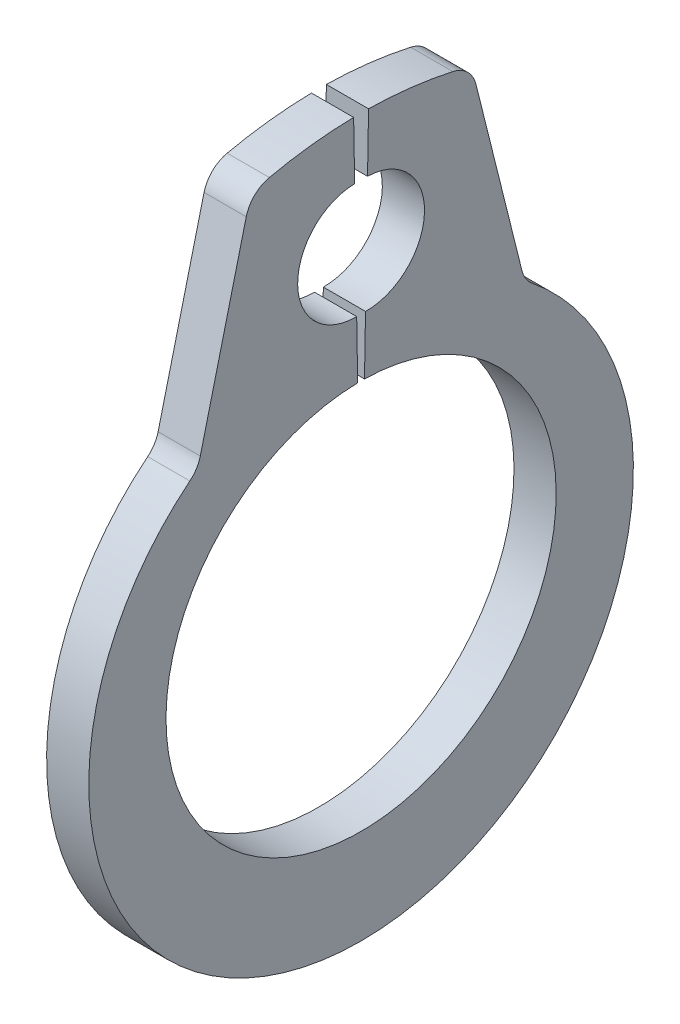
ISO-10303-21;
HEADER;
FILE_DESCRIPTION(('STEP AP214'),'2;1');
FILE_NAME('part.step','',(''),(''),'','','');
FILE_SCHEMA(('AUTOMOTIVE_DESIGN { 1 0 10303 214 1 1 1 1 }'));
ENDSEC;
DATA;
#1=APPLICATION_CONTEXT('core data for automotive mechanical design processes');
#2=APPLICATION_PROTOCOL_DEFINITION('international standard','automotive_design',2000,#1);
#3=PRODUCT_CONTEXT('',#1,'mechanical');
#4=PRODUCT('Part','Part','',(#3));
#5=PRODUCT_RELATED_PRODUCT_CATEGORY('part','',(#4));
#6=PRODUCT_DEFINITION_FORMATION('','',#4);
#7=PRODUCT_DEFINITION_CONTEXT('part definition',#1,'design');
#8=PRODUCT_DEFINITION('design','',#6,#7);
#9=PRODUCT_DEFINITION_SHAPE('','',#8);
#10=(LENGTH_UNIT() NAMED_UNIT(*) SI_UNIT(.MILLI.,.METRE.));
#11=(NAMED_UNIT(*) PLANE_ANGLE_UNIT() SI_UNIT($,.RADIAN.));
#12=(NAMED_UNIT(*) SI_UNIT($,.STERADIAN.) SOLID_ANGLE_UNIT());
#13=UNCERTAINTY_MEASURE_WITH_UNIT(LENGTH_MEASURE(1.E-05),#10,'distance_accuracy_value','');
#14=(GEOMETRIC_REPRESENTATION_CONTEXT(3) GLOBAL_UNCERTAINTY_ASSIGNED_CONTEXT((#13)) GLOBAL_UNIT_ASSIGNED_CONTEXT((#10,
#11,#12)) REPRESENTATION_CONTEXT('',''));
#15=CARTESIAN_POINT('',(0.,0.,0.));
#16=DIRECTION('',(0.,0.,1.));
#17=DIRECTION('',(1.,0.,0.));
#18=AXIS2_PLACEMENT_3D('',#15,#16,#17);
#19=CARTESIAN_POINT('',(0.2,0.,0.));
#20=DIRECTION('',(-1.,0.,0.));
#21=DIRECTION('',(0.,0.,1.));
#22=AXIS2_PLACEMENT_3D('',#19,#20,#21);
#23=CYLINDRICAL_SURFACE('',#22,1.85);
#24=CARTESIAN_POINT('',(-0.2,0.,0.));
#25=DIRECTION('',(-1.,0.,0.));
#26=DIRECTION('',(0.,0.,-1.));
#27=AXIS2_PLACEMENT_3D('',#24,#25,#26);
#28=CIRCLE('',#27,1.85);
#29=CARTESIAN_POINT('',(-0.2,1.84971823603932,-0.0322869519089746));
#30=VERTEX_POINT('',#29);
#31=CARTESIAN_POINT('',(-0.2,1.84971823603932,0.0322869519089746));
#32=VERTEX_POINT('',#31);
#33=EDGE_CURVE('E167',#30,#32,#28,.T.);
#34=ORIENTED_EDGE('',*,*,#33,.T.);
#35=DIRECTION('',(-1.,0.,0.));
#36=VECTOR('',#35,1.);
#37=CARTESIAN_POINT('',(0.2,1.84971823603932,0.0322869519089746));
#38=LINE('',#37,#36);
#39=CARTESIAN_POINT('',(0.2,1.84971823603932,0.0322869519089746));
#40=VERTEX_POINT('',#39);
#41=EDGE_CURVE('E148',#40,#32,#38,.T.);
#42=ORIENTED_EDGE('',*,*,#41,.F.);
#43=CARTESIAN_POINT('',(0.2,0.,0.));
#44=DIRECTION('',(-1.,0.,0.));
#45=DIRECTION('',(0.,0.,-1.));
#46=AXIS2_PLACEMENT_3D('',#43,#44,#45);
#47=CIRCLE('',#46,1.85);
#48=CARTESIAN_POINT('',(0.2,1.84971823603932,-0.0322869519089746));
#49=VERTEX_POINT('',#48);
#50=EDGE_CURVE('E154',#49,#40,#47,.T.);
#51=ORIENTED_EDGE('',*,*,#50,.F.);
#52=DIRECTION('',(-1.,0.,0.));
#53=VECTOR('',#52,1.);
#54=CARTESIAN_POINT('',(0.2,1.84971823603932,-0.0322869519089746));
#55=LINE('',#54,#53);
#56=EDGE_CURVE('E236',#49,#30,#55,.T.);
#57=ORIENTED_EDGE('',*,*,#56,.T.);
#58=EDGE_LOOP('',(#34,#42,#51,#57));
#59=FACE_BOUND('',#58,.T.);
#60=ADVANCED_FACE('F30',(#59),#23,.F.);
#61=CARTESIAN_POINT('',(0.2,2.39963446837534,0.0418857754494805));
#62=DIRECTION('',(0.,-0.0174524064372835,0.999847695156391));
#63=DIRECTION('',(0.,-0.999847695156391,-0.0174524064372835));
#64=AXIS2_PLACEMENT_3D('',#61,#62,#63);
#65=PLANE('',#64);
#66=DIRECTION('',(0.,0.999847695156391,0.0174524064372835));
#67=VECTOR('',#66,1.);
#68=CARTESIAN_POINT('',(-0.2,2.39963446837534,0.0418857754494805));
#69=LINE('',#68,#67);
#70=CARTESIAN_POINT('',(-0.2,2.39963446837534,0.0418857754494805));
#71=VERTEX_POINT('',#70);
#72=EDGE_CURVE('E238',#32,#71,#69,.T.);
#73=ORIENTED_EDGE('',*,*,#72,.T.);
#74=DIRECTION('',(-1.,0.,0.));
#75=VECTOR('',#74,1.);
#76=CARTESIAN_POINT('',(0.2,2.39963446837534,0.0418857754494805));
#77=LINE('',#76,#75);
#78=CARTESIAN_POINT('',(0.2,2.39963446837534,0.0418857754494805));
#79=VERTEX_POINT('',#78);
#80=EDGE_CURVE('E151',#79,#71,#77,.T.);
#81=ORIENTED_EDGE('',*,*,#80,.F.);
#82=DIRECTION('',(0.,0.999847695156391,0.0174524064372835));
#83=VECTOR('',#82,1.);
#84=CARTESIAN_POINT('',(0.2,2.39963446837534,0.0418857754494805));
#85=LINE('',#84,#83);
#86=EDGE_CURVE('E144',#40,#79,#85,.T.);
#87=ORIENTED_EDGE('',*,*,#86,.F.);
#88=ORIENTED_EDGE('',*,*,#41,.T.);
#89=EDGE_LOOP('',(#73,#81,#87,#88));
#90=FACE_BOUND('',#89,.T.);
#91=ADVANCED_FACE('F146',(#90),#65,.F.);
#92=CARTESIAN_POINT('',(0.2,2.94955070071135,0.0514845989899865));
#93=DIRECTION('',(-1.,0.,0.));
#94=DIRECTION('',(0.,0.,1.));
#95=AXIS2_PLACEMENT_3D('',#92,#93,#94);
#96=CYLINDRICAL_SURFACE('',#95,0.55);
#97=CARTESIAN_POINT('',(-0.2,2.94955070071135,0.0514845989899865));
#98=DIRECTION('',(-1.,0.,0.));
#99=DIRECTION('',(0.,0.,1.));
#100=AXIS2_PLACEMENT_3D('',#97,#98,#99);
#101=CIRCLE('',#100,0.55);
#102=CARTESIAN_POINT('',(-0.2,3.49946693304737,0.0610834225304923));
#103=VERTEX_POINT('',#102);
#104=EDGE_CURVE('E240',#71,#103,#101,.T.);
#105=ORIENTED_EDGE('',*,*,#104,.T.);
#106=DIRECTION('',(-1.,0.,0.));
#107=VECTOR('',#106,1.);
#108=CARTESIAN_POINT('',(0.2,3.49946693304737,0.0610834225304923));
#109=LINE('',#108,#107);
#110=CARTESIAN_POINT('',(0.2,3.49946693304737,0.0610834225304923));
#111=VERTEX_POINT('',#110);
#112=EDGE_CURVE('E172',#111,#103,#109,.T.);
#113=ORIENTED_EDGE('',*,*,#112,.F.);
#114=CARTESIAN_POINT('',(0.2,2.94955070071135,0.0514845989899865));
#115=DIRECTION('',(-1.,0.,0.));
#116=DIRECTION('',(0.,0.,1.));
#117=AXIS2_PLACEMENT_3D('',#114,#115,#116);
#118=CIRCLE('',#117,0.55);
#119=EDGE_CURVE('E153',#79,#111,#118,.T.);
#120=ORIENTED_EDGE('',*,*,#119,.F.);
#121=ORIENTED_EDGE('',*,*,#80,.T.);
#122=EDGE_LOOP('',(#105,#113,#120,#121));
#123=FACE_BOUND('',#122,.T.);
#124=ADVANCED_FACE('F298',(#123),#96,.F.);
#125=CARTESIAN_POINT('',(0.2,3.49946693304737,0.0610834225304924));
#126=DIRECTION('',(0.,-0.0174524064372836,0.999847695156391));
#127=DIRECTION('',(0.,-0.999847695156391,-0.0174524064372836));
#128=AXIS2_PLACEMENT_3D('',#125,#126,#127);
#129=PLANE('',#128);
#130=DIRECTION('',(0.,0.999847695156391,0.0174524064372836));
#131=VECTOR('',#130,1.);
#132=CARTESIAN_POINT('',(-0.2,3.49946693304737,0.0610834225304924));
#133=LINE('',#132,#131);
#134=CARTESIAN_POINT('',(-0.2,4.04938316538338,0.0706822460709984));
#135=VERTEX_POINT('',#134);
#136=EDGE_CURVE('E242',#103,#135,#133,.T.);
#137=ORIENTED_EDGE('',*,*,#136,.T.);
#138=DIRECTION('',(-1.,0.,0.));
#139=VECTOR('',#138,1.);
#140=CARTESIAN_POINT('',(0.2,4.04938316538338,0.0706822460709984));
#141=LINE('',#140,#139);
#142=CARTESIAN_POINT('',(0.2,4.04938316538338,0.0706822460709984));
#143=VERTEX_POINT('',#142);
#144=EDGE_CURVE('E267',#143,#135,#141,.T.);
#145=ORIENTED_EDGE('',*,*,#144,.F.);
#146=DIRECTION('',(0.,0.999847695156391,0.0174524064372836));
#147=VECTOR('',#146,1.);
#148=CARTESIAN_POINT('',(0.2,3.49946693304737,0.0610834225304924));
#149=LINE('',#148,#147);
#150=EDGE_CURVE('E276',#111,#143,#149,.T.);
#151=ORIENTED_EDGE('',*,*,#150,.F.);
#152=ORIENTED_EDGE('',*,*,#112,.T.);
#153=EDGE_LOOP('',(#137,#145,#151,#152));
#154=FACE_BOUND('',#153,.T.);
#155=ADVANCED_FACE('F274',(#154),#129,.F.);
#156=CARTESIAN_POINT('',(0.2,0.,0.));
#157=DIRECTION('',(-1.,0.,0.));
#158=DIRECTION('',(0.,0.,1.));
#159=AXIS2_PLACEMENT_3D('',#156,#157,#158);
#160=CYLINDRICAL_SURFACE('',#159,4.05);
#161=CARTESIAN_POINT('',(-0.2,0.,0.));
#162=DIRECTION('',(1.,0.,0.));
#163=DIRECTION('',(0.,0.,-1.));
#164=AXIS2_PLACEMENT_3D('',#161,#162,#163);
#165=CIRCLE('',#164,4.05);
#166=CARTESIAN_POINT('',(-0.2,3.95543553775241,0.870074540878729));
#167=VERTEX_POINT('',#166);
#168=EDGE_CURVE('E244',#135,#167,#165,.T.);
#169=ORIENTED_EDGE('',*,*,#168,.T.);
#170=DIRECTION('',(-1.,0.,0.));
#171=VECTOR('',#170,1.);
#172=CARTESIAN_POINT('',(0.2,3.95543553775241,0.870074540878729));
#173=LINE('',#172,#171);
#174=CARTESIAN_POINT('',(0.2,3.95543553775241,0.870074540878729));
#175=VERTEX_POINT('',#174);
#176=EDGE_CURVE('E187',#167,#175,#173,.F.);
#177=ORIENTED_EDGE('',*,*,#176,.T.);
#178=CARTESIAN_POINT('',(0.2,0.,0.));
#179=DIRECTION('',(1.,0.,0.));
#180=DIRECTION('',(0.,0.,-1.));
#181=AXIS2_PLACEMENT_3D('',#178,#179,#180);
#182=CIRCLE('',#181,4.05);
#183=EDGE_CURVE('E291',#143,#175,#182,.T.);
#184=ORIENTED_EDGE('',*,*,#183,.F.);
#185=ORIENTED_EDGE('',*,*,#144,.T.);
#186=EDGE_LOOP('',(#169,#177,#184,#185));
#187=FACE_BOUND('',#186,.T.);
#188=ADVANCED_FACE('F282',(#187),#160,.T.);
#189=CARTESIAN_POINT('',(0.2,3.91238787086019,1.04676699792556));
#190=DIRECTION('',(0.,-0.241921895599665,-0.970295726275997));
#191=DIRECTION('',(0.,0.970295726275997,-0.241921895599665));
#192=AXIS2_PLACEMENT_3D('',#189,#190,#191);
#193=PLANE('',#192);
#194=DIRECTION('',(0.,-0.970295726275997,0.241921895599665));
#195=VECTOR('',#194,1.);
#196=CARTESIAN_POINT('',(-0.2,3.91238787086019,1.04676699792556));
#197=LINE('',#196,#195);
#198=CARTESIAN_POINT('',(-0.2,3.74236416995824,1.08915866770745));
#199=VERTEX_POINT('',#198);
#200=CARTESIAN_POINT('',(-0.2,1.99527260257338,1.52475751898768));
#201=VERTEX_POINT('',#200);
#202=EDGE_CURVE('E218',#199,#201,#197,.T.);
#203=ORIENTED_EDGE('',*,*,#202,.T.);
#204=DIRECTION('',(1.,0.,0.));
#205=VECTOR('',#204,1.);
#206=CARTESIAN_POINT('',(0.2,1.99527260257338,1.52475751898768));
#207=LINE('',#206,#205);
#208=CARTESIAN_POINT('',(0.2,1.99527260257338,1.52475751898768));
#209=VERTEX_POINT('',#208);
#210=EDGE_CURVE('E181',#201,#209,#207,.T.);
#211=ORIENTED_EDGE('',*,*,#210,.T.);
#212=DIRECTION('',(0.,-0.970295726275997,0.241921895599665));
#213=VECTOR('',#212,1.);
#214=CARTESIAN_POINT('',(0.2,3.91238787086019,1.04676699792556));
#215=LINE('',#214,#213);
#216=CARTESIAN_POINT('',(0.2,3.74236416995824,1.08915866770745));
#217=VERTEX_POINT('',#216);
#218=EDGE_CURVE('E228',#217,#209,#215,.T.);
#219=ORIENTED_EDGE('',*,*,#218,.F.);
#220=DIRECTION('',(-1.,0.,0.));
#221=VECTOR('',#220,1.);
#222=CARTESIAN_POINT('',(0.2,3.74236416995824,1.08915866770745));
#223=LINE('',#222,#221);
#224=EDGE_CURVE('E178',#217,#199,#223,.T.);
#225=ORIENTED_EDGE('',*,*,#224,.T.);
#226=EDGE_LOOP('',(#203,#211,#219,#225));
#227=FACE_BOUND('',#226,.T.);
#228=ADVANCED_FACE('F293',(#227),#193,.F.);
#229=CARTESIAN_POINT('',(0.2,-0.167806196705348,0.));
#230=DIRECTION('',(-1.,0.,0.));
#231=DIRECTION('',(0.,0.,1.));
#232=AXIS2_PLACEMENT_3D('',#229,#230,#231);
#233=CYLINDRICAL_SURFACE('',#232,2.58219380329465);
#234=CARTESIAN_POINT('',(0.2,-0.167806196705348,0.));
#235=DIRECTION('',(1.,0.,0.));
#236=DIRECTION('',(0.,0.,-1.));
#237=AXIS2_PLACEMENT_3D('',#234,#235,#236);
#238=CIRCLE('',#237,2.58219380329465);
#239=CARTESIAN_POINT('',(0.2,1.83994430349884,1.62378039361951));
#240=VERTEX_POINT('',#239);
#241=CARTESIAN_POINT('',(0.2,1.83994430349883,-1.62378039361952));
#242=VERTEX_POINT('',#241);
#243=EDGE_CURVE('E222',#240,#242,#238,.T.);
#244=ORIENTED_EDGE('',*,*,#243,.F.);
#245=DIRECTION('',(-1.,0.,0.));
#246=VECTOR('',#245,1.);
#247=CARTESIAN_POINT('',(0.2,1.83994430349884,1.62378039361951));
#248=LINE('',#247,#246);
#249=CARTESIAN_POINT('',(-0.2,1.83994430349884,1.62378039361951));
#250=VERTEX_POINT('',#249);
#251=EDGE_CURVE('E170',#240,#250,#248,.T.);
#252=ORIENTED_EDGE('',*,*,#251,.T.);
#253=CARTESIAN_POINT('',(-0.2,-0.167806196705348,0.));
#254=DIRECTION('',(1.,0.,0.));
#255=DIRECTION('',(0.,0.,-1.));
#256=AXIS2_PLACEMENT_3D('',#253,#254,#255);
#257=CIRCLE('',#256,2.58219380329465);
#258=CARTESIAN_POINT('',(-0.2,1.83994430349883,-1.62378039361952));
#259=VERTEX_POINT('',#258);
#260=EDGE_CURVE('E208',#250,#259,#257,.T.);
#261=ORIENTED_EDGE('',*,*,#260,.T.);
#262=DIRECTION('',(-1.,0.,0.));
#263=VECTOR('',#262,1.);
#264=CARTESIAN_POINT('',(0.2,1.83994430349883,-1.62378039361952));
#265=LINE('',#264,#263);
#266=EDGE_CURVE('E168',#259,#242,#265,.F.);
#267=ORIENTED_EDGE('',*,*,#266,.T.);
#268=EDGE_LOOP('',(#244,#252,#261,#267));
#269=FACE_BOUND('',#268,.T.);
#270=ADVANCED_FACE('F215',(#269),#233,.T.);
#271=CARTESIAN_POINT('',(0.2,3.91238787086018,-1.04676699792556));
#272=DIRECTION('',(0.,-0.241921895599666,0.970295726275997));
#273=DIRECTION('',(0.,-0.970295726275997,-0.241921895599666));
#274=AXIS2_PLACEMENT_3D('',#271,#272,#273);
#275=PLANE('',#274);
#276=DIRECTION('',(0.,0.970295726275997,0.241921895599666));
#277=VECTOR('',#276,1.);
#278=CARTESIAN_POINT('',(-0.2,3.91238787086018,-1.04676699792556));
#279=LINE('',#278,#277);
#280=CARTESIAN_POINT('',(-0.2,1.99527260257337,-1.52475751898768));
#281=VERTEX_POINT('',#280);
#282=CARTESIAN_POINT('',(-0.2,3.74236416995823,-1.08915866770745));
#283=VERTEX_POINT('',#282);
#284=EDGE_CURVE('E209',#281,#283,#279,.T.);
#285=ORIENTED_EDGE('',*,*,#284,.T.);
#286=DIRECTION('',(-1.,0.,0.));
#287=VECTOR('',#286,1.);
#288=CARTESIAN_POINT('',(0.2,3.74236416995823,-1.08915866770745));
#289=LINE('',#288,#287);
#290=CARTESIAN_POINT('',(0.2,3.74236416995823,-1.08915866770745));
#291=VERTEX_POINT('',#290);
#292=EDGE_CURVE('E53',#283,#291,#289,.F.);
#293=ORIENTED_EDGE('',*,*,#292,.T.);
#294=DIRECTION('',(0.,0.970295726275997,0.241921895599666));
#295=VECTOR('',#294,1.);
#296=CARTESIAN_POINT('',(0.2,3.91238787086018,-1.04676699792556));
#297=LINE('',#296,#295);
#298=CARTESIAN_POINT('',(0.2,1.99527260257337,-1.52475751898768));
#299=VERTEX_POINT('',#298);
#300=EDGE_CURVE('E221',#299,#291,#297,.T.);
#301=ORIENTED_EDGE('',*,*,#300,.F.);
#302=DIRECTION('',(1.,0.,0.));
#303=VECTOR('',#302,1.);
#304=CARTESIAN_POINT('',(-0.2,1.99527260257337,-1.52475751898768));
#305=LINE('',#304,#303);
#306=EDGE_CURVE('E195',#299,#281,#305,.F.);
#307=ORIENTED_EDGE('',*,*,#306,.T.);
#308=EDGE_LOOP('',(#285,#293,#301,#307));
#309=FACE_BOUND('',#308,.T.);
#310=ADVANCED_FACE('F223',(#309),#275,.F.);
#311=CARTESIAN_POINT('',(0.2,0.,0.));
#312=DIRECTION('',(-1.,0.,0.));
#313=DIRECTION('',(0.,0.,1.));
#314=AXIS2_PLACEMENT_3D('',#311,#312,#313);
#315=CYLINDRICAL_SURFACE('',#314,4.05);
#316=CARTESIAN_POINT('',(0.2,0.,0.));
#317=DIRECTION('',(1.,0.,0.));
#318=DIRECTION('',(0.,0.,1.));
#319=AXIS2_PLACEMENT_3D('',#316,#317,#318);
#320=CIRCLE('',#319,4.05);
#321=CARTESIAN_POINT('',(0.2,3.9554355377524,-0.87007454087873));
#322=VERTEX_POINT('',#321);
#323=CARTESIAN_POINT('',(0.2,4.04938316538338,-0.0706822460709989));
#324=VERTEX_POINT('',#323);
#325=EDGE_CURVE('E224',#322,#324,#320,.T.);
#326=ORIENTED_EDGE('',*,*,#325,.F.);
#327=DIRECTION('',(-1.,0.,0.));
#328=VECTOR('',#327,1.);
#329=CARTESIAN_POINT('',(0.2,3.9554355377524,-0.87007454087873));
#330=LINE('',#329,#328);
#331=CARTESIAN_POINT('',(-0.2,3.9554355377524,-0.87007454087873));
#332=VERTEX_POINT('',#331);
#333=EDGE_CURVE('E192',#322,#332,#330,.T.);
#334=ORIENTED_EDGE('',*,*,#333,.T.);
#335=CARTESIAN_POINT('',(-0.2,0.,0.));
#336=DIRECTION('',(1.,0.,0.));
#337=DIRECTION('',(0.,0.,1.));
#338=AXIS2_PLACEMENT_3D('',#335,#336,#337);
#339=CIRCLE('',#338,4.05);
#340=CARTESIAN_POINT('',(-0.2,4.04938316538338,-0.0706822460709989));
#341=VERTEX_POINT('',#340);
#342=EDGE_CURVE('E250',#332,#341,#339,.T.);
#343=ORIENTED_EDGE('',*,*,#342,.T.);
#344=DIRECTION('',(-1.,0.,0.));
#345=VECTOR('',#344,1.);
#346=CARTESIAN_POINT('',(0.2,4.04938316538338,-0.0706822460709989));
#347=LINE('',#346,#345);
#348=EDGE_CURVE('E264',#324,#341,#347,.T.);
#349=ORIENTED_EDGE('',*,*,#348,.F.);
#350=EDGE_LOOP('',(#326,#334,#343,#349));
#351=FACE_BOUND('',#350,.T.);
#352=ADVANCED_FACE('F326',(#351),#315,.T.);
#353=CARTESIAN_POINT('',(0.2,3.49946693304737,-0.0610834225304929));
#354=DIRECTION('',(0.,-0.0174524064372837,-0.999847695156391));
#355=DIRECTION('',(0.,0.999847695156391,-0.0174524064372837));
#356=AXIS2_PLACEMENT_3D('',#353,#354,#355);
#357=PLANE('',#356);
#358=DIRECTION('',(0.,-0.999847695156391,0.0174524064372837));
#359=VECTOR('',#358,1.);
#360=CARTESIAN_POINT('',(-0.2,3.49946693304737,-0.0610834225304929));
#361=LINE('',#360,#359);
#362=CARTESIAN_POINT('',(-0.2,3.49946693304737,-0.0610834225304929));
#363=VERTEX_POINT('',#362);
#364=EDGE_CURVE('E252',#341,#363,#361,.T.);
#365=ORIENTED_EDGE('',*,*,#364,.T.);
#366=DIRECTION('',(-1.,0.,0.));
#367=VECTOR('',#366,1.);
#368=CARTESIAN_POINT('',(0.2,3.49946693304737,-0.0610834225304929));
#369=LINE('',#368,#367);
#370=CARTESIAN_POINT('',(0.2,3.49946693304737,-0.0610834225304929));
#371=VERTEX_POINT('',#370);
#372=EDGE_CURVE('E261',#371,#363,#369,.T.);
#373=ORIENTED_EDGE('',*,*,#372,.F.);
#374=DIRECTION('',(0.,-0.999847695156391,0.0174524064372837));
#375=VECTOR('',#374,1.);
#376=CARTESIAN_POINT('',(0.2,3.49946693304737,-0.0610834225304929));
#377=LINE('',#376,#375);
#378=EDGE_CURVE('E226',#324,#371,#377,.T.);
#379=ORIENTED_EDGE('',*,*,#378,.F.);
#380=ORIENTED_EDGE('',*,*,#348,.T.);
#381=EDGE_LOOP('',(#365,#373,#379,#380));
#382=FACE_BOUND('',#381,.T.);
#383=ADVANCED_FACE('F333',(#382),#357,.F.);
#384=CARTESIAN_POINT('',(0.2,2.94955070071135,-0.0514845989899869));
#385=DIRECTION('',(-1.,0.,0.));
#386=DIRECTION('',(0.,0.,1.));
#387=AXIS2_PLACEMENT_3D('',#384,#385,#386);
#388=CYLINDRICAL_SURFACE('',#387,0.55);
#389=CARTESIAN_POINT('',(-0.2,2.94955070071135,-0.0514845989899869));
#390=DIRECTION('',(-1.,0.,0.));
#391=DIRECTION('',(0.,0.,1.));
#392=AXIS2_PLACEMENT_3D('',#389,#390,#391);
#393=CIRCLE('',#392,0.55);
#394=CARTESIAN_POINT('',(-0.2,2.39963446837534,-0.0418857754494811));
#395=VERTEX_POINT('',#394);
#396=EDGE_CURVE('E254',#363,#395,#393,.T.);
#397=ORIENTED_EDGE('',*,*,#396,.T.);
#398=DIRECTION('',(-1.,0.,0.));
#399=VECTOR('',#398,1.);
#400=CARTESIAN_POINT('',(0.2,2.39963446837534,-0.0418857754494811));
#401=LINE('',#400,#399);
#402=CARTESIAN_POINT('',(0.2,2.39963446837534,-0.0418857754494811));
#403=VERTEX_POINT('',#402);
#404=EDGE_CURVE('E258',#403,#395,#401,.T.);
#405=ORIENTED_EDGE('',*,*,#404,.F.);
#406=CARTESIAN_POINT('',(0.2,2.94955070071135,-0.0514845989899869));
#407=DIRECTION('',(-1.,0.,0.));
#408=DIRECTION('',(0.,0.,1.));
#409=AXIS2_PLACEMENT_3D('',#406,#407,#408);
#410=CIRCLE('',#409,0.55);
#411=EDGE_CURVE('E233',#371,#403,#410,.T.);
#412=ORIENTED_EDGE('',*,*,#411,.F.);
#413=ORIENTED_EDGE('',*,*,#372,.T.);
#414=EDGE_LOOP('',(#397,#405,#412,#413));
#415=FACE_BOUND('',#414,.T.);
#416=ADVANCED_FACE('F337',(#415),#388,.F.);
#417=CARTESIAN_POINT('',(0.2,1.84971823603932,-0.0322869519089746));
#418=DIRECTION('',(0.,-0.0174524064372842,-0.999847695156391));
#419=DIRECTION('',(0.,0.999847695156391,-0.0174524064372842));
#420=AXIS2_PLACEMENT_3D('',#417,#418,#419);
#421=PLANE('',#420);
#422=DIRECTION('',(0.,-0.999847695156391,0.0174524064372842));
#423=VECTOR('',#422,1.);
#424=CARTESIAN_POINT('',(-0.2,1.84971823603932,-0.0322869519089746));
#425=LINE('',#424,#423);
#426=EDGE_CURVE('E164',#395,#30,#425,.T.);
#427=ORIENTED_EDGE('',*,*,#426,.T.);
#428=ORIENTED_EDGE('',*,*,#56,.F.);
#429=DIRECTION('',(0.,-0.999847695156391,0.0174524064372842));
#430=VECTOR('',#429,1.);
#431=CARTESIAN_POINT('',(0.2,1.84971823603932,-0.0322869519089746));
#432=LINE('',#431,#430);
#433=EDGE_CURVE('E160',#403,#49,#432,.T.);
#434=ORIENTED_EDGE('',*,*,#433,.F.);
#435=ORIENTED_EDGE('',*,*,#404,.T.);
#436=EDGE_LOOP('',(#427,#428,#434,#435));
#437=FACE_BOUND('',#436,.T.);
#438=ADVANCED_FACE('F340',(#437),#421,.F.);
#439=CARTESIAN_POINT('',(0.2,0.,0.));
#440=DIRECTION('',(1.,0.,0.));
#441=DIRECTION('',(0.,0.,-1.));
#442=AXIS2_PLACEMENT_3D('',#439,#440,#441);
#443=PLANE('',#442);
#444=ORIENTED_EDGE('',*,*,#183,.T.);
#445=CARTESIAN_POINT('',(0.2,3.67220682023433,0.807772907087413));
#446=DIRECTION('',(1.,0.,0.));
#447=DIRECTION('',(0.,0.,-1.));
#448=AXIS2_PLACEMENT_3D('',#445,#446,#447);
#449=CIRCLE('',#448,0.29);
#450=EDGE_CURVE('E190',#175,#217,#449,.T.);
#451=ORIENTED_EDGE('',*,*,#450,.T.);
#452=ORIENTED_EDGE('',*,*,#218,.T.);
#453=CARTESIAN_POINT('',(0.2,2.06542995229728,1.80614327960772));
#454=DIRECTION('',(1.,0.,0.));
#455=DIRECTION('',(0.,0.,-1.));
#456=AXIS2_PLACEMENT_3D('',#453,#454,#455);
#457=CIRCLE('',#456,0.29);
#458=EDGE_CURVE('E201',#209,#240,#457,.F.);
#459=ORIENTED_EDGE('',*,*,#458,.T.);
#460=ORIENTED_EDGE('',*,*,#243,.T.);
#461=CARTESIAN_POINT('',(0.2,2.06542995229728,-1.80614327960772));
#462=DIRECTION('',(1.,0.,0.));
#463=DIRECTION('',(0.,0.,-1.));
#464=AXIS2_PLACEMENT_3D('',#461,#462,#463);
#465=CIRCLE('',#464,0.29);
#466=EDGE_CURVE('E11',#242,#299,#465,.F.);
#467=ORIENTED_EDGE('',*,*,#466,.T.);
#468=ORIENTED_EDGE('',*,*,#300,.T.);
#469=CARTESIAN_POINT('',(0.2,3.67220682023433,-0.807772907087413));
#470=DIRECTION('',(1.,0.,0.));
#471=DIRECTION('',(0.,0.,-1.));
#472=AXIS2_PLACEMENT_3D('',#469,#470,#471);
#473=CIRCLE('',#472,0.29);
#474=EDGE_CURVE('E45',#291,#322,#473,.T.);
#475=ORIENTED_EDGE('',*,*,#474,.T.);
#476=ORIENTED_EDGE('',*,*,#325,.T.);
#477=ORIENTED_EDGE('',*,*,#378,.T.);
#478=ORIENTED_EDGE('',*,*,#411,.T.);
#479=ORIENTED_EDGE('',*,*,#433,.T.);
#480=ORIENTED_EDGE('',*,*,#50,.T.);
#481=ORIENTED_EDGE('',*,*,#86,.T.);
#482=ORIENTED_EDGE('',*,*,#119,.T.);
#483=ORIENTED_EDGE('',*,*,#150,.T.);
#484=EDGE_LOOP('',(#444,#451,#452,#459,#460,#467,#468,#475,#476,#477,#478,#479,#480,#481,#482,#483));
#485=FACE_BOUND('',#484,.T.);
#486=ADVANCED_FACE('F158',(#485),#443,.T.);
#487=CARTESIAN_POINT('',(-0.2,0.,0.));
#488=DIRECTION('',(1.,0.,0.));
#489=DIRECTION('',(0.,0.,-1.));
#490=AXIS2_PLACEMENT_3D('',#487,#488,#489);
#491=PLANE('',#490);
#492=ORIENTED_EDGE('',*,*,#202,.F.);
#493=CARTESIAN_POINT('',(-0.2,3.67220682023433,0.807772907087413));
#494=DIRECTION('',(1.,0.,0.));
#495=DIRECTION('',(0.,0.,-1.));
#496=AXIS2_PLACEMENT_3D('',#493,#494,#495);
#497=CIRCLE('',#496,0.29);
#498=EDGE_CURVE('E185',#199,#167,#497,.F.);
#499=ORIENTED_EDGE('',*,*,#498,.T.);
#500=ORIENTED_EDGE('',*,*,#168,.F.);
#501=ORIENTED_EDGE('',*,*,#136,.F.);
#502=ORIENTED_EDGE('',*,*,#104,.F.);
#503=ORIENTED_EDGE('',*,*,#72,.F.);
#504=ORIENTED_EDGE('',*,*,#33,.F.);
#505=ORIENTED_EDGE('',*,*,#426,.F.);
#506=ORIENTED_EDGE('',*,*,#396,.F.);
#507=ORIENTED_EDGE('',*,*,#364,.F.);
#508=ORIENTED_EDGE('',*,*,#342,.F.);
#509=CARTESIAN_POINT('',(-0.2,3.67220682023433,-0.807772907087413));
#510=DIRECTION('',(1.,0.,0.));
#511=DIRECTION('',(0.,0.,-1.));
#512=AXIS2_PLACEMENT_3D('',#509,#510,#511);
#513=CIRCLE('',#512,0.29);
#514=EDGE_CURVE('E183',#332,#283,#513,.F.);
#515=ORIENTED_EDGE('',*,*,#514,.T.);
#516=ORIENTED_EDGE('',*,*,#284,.F.);
#517=CARTESIAN_POINT('',(-0.2,2.06542995229728,-1.80614327960772));
#518=DIRECTION('',(1.,0.,0.));
#519=DIRECTION('',(0.,0.,-1.));
#520=AXIS2_PLACEMENT_3D('',#517,#518,#519);
#521=CIRCLE('',#520,0.29);
#522=EDGE_CURVE('E38',#281,#259,#521,.T.);
#523=ORIENTED_EDGE('',*,*,#522,.T.);
#524=ORIENTED_EDGE('',*,*,#260,.F.);
#525=CARTESIAN_POINT('',(-0.2,2.06542995229728,1.80614327960772));
#526=DIRECTION('',(1.,0.,0.));
#527=DIRECTION('',(0.,0.,-1.));
#528=AXIS2_PLACEMENT_3D('',#525,#526,#527);
#529=CIRCLE('',#528,0.29);
#530=EDGE_CURVE('E199',#250,#201,#529,.T.);
#531=ORIENTED_EDGE('',*,*,#530,.T.);
#532=EDGE_LOOP('',(#492,#499,#500,#501,#502,#503,#504,#505,#506,#507,#508,#515,#516,#523,#524,#531));
#533=FACE_BOUND('',#532,.T.);
#534=ADVANCED_FACE('F207',(#533),#491,.F.);
#535=CARTESIAN_POINT('',(0.2,2.06542995229728,1.80614327960772));
#536=DIRECTION('',(-1.,0.,0.));
#537=DIRECTION('',(0.,0.,1.));
#538=AXIS2_PLACEMENT_3D('',#535,#536,#537);
#539=CYLINDRICAL_SURFACE('',#538,0.29);
#540=ORIENTED_EDGE('',*,*,#458,.F.);
#541=ORIENTED_EDGE('',*,*,#210,.F.);
#542=ORIENTED_EDGE('',*,*,#530,.F.);
#543=ORIENTED_EDGE('',*,*,#251,.F.);
#544=EDGE_LOOP('',(#540,#541,#542,#543));
#545=FACE_BOUND('',#544,.T.);
#546=ADVANCED_FACE('F312',(#545),#539,.F.);
#547=CARTESIAN_POINT('',(0.2,3.67220682023433,0.807772907087413));
#548=DIRECTION('',(-1.,0.,0.));
#549=DIRECTION('',(0.,0.,1.));
#550=AXIS2_PLACEMENT_3D('',#547,#548,#549);
#551=CYLINDRICAL_SURFACE('',#550,0.29);
#552=ORIENTED_EDGE('',*,*,#450,.F.);
#553=ORIENTED_EDGE('',*,*,#176,.F.);
#554=ORIENTED_EDGE('',*,*,#498,.F.);
#555=ORIENTED_EDGE('',*,*,#224,.F.);
#556=EDGE_LOOP('',(#552,#553,#554,#555));
#557=FACE_BOUND('',#556,.T.);
#558=ADVANCED_FACE('F286',(#557),#551,.T.);
#559=CARTESIAN_POINT('',(0.2,3.67220682023433,-0.807772907087413));
#560=DIRECTION('',(-1.,0.,0.));
#561=DIRECTION('',(0.,0.,1.));
#562=AXIS2_PLACEMENT_3D('',#559,#560,#561);
#563=CYLINDRICAL_SURFACE('',#562,0.29);
#564=ORIENTED_EDGE('',*,*,#474,.F.);
#565=ORIENTED_EDGE('',*,*,#292,.F.);
#566=ORIENTED_EDGE('',*,*,#514,.F.);
#567=ORIENTED_EDGE('',*,*,#333,.F.);
#568=EDGE_LOOP('',(#564,#565,#566,#567));
#569=FACE_BOUND('',#568,.T.);
#570=ADVANCED_FACE('F317',(#569),#563,.T.);
#571=CARTESIAN_POINT('',(0.2,2.06542995229728,-1.80614327960772));
#572=DIRECTION('',(-1.,0.,0.));
#573=DIRECTION('',(0.,0.,1.));
#574=AXIS2_PLACEMENT_3D('',#571,#572,#573);
#575=CYLINDRICAL_SURFACE('',#574,0.29);
#576=ORIENTED_EDGE('',*,*,#466,.F.);
#577=ORIENTED_EDGE('',*,*,#266,.F.);
#578=ORIENTED_EDGE('',*,*,#522,.F.);
#579=ORIENTED_EDGE('',*,*,#306,.F.);
#580=EDGE_LOOP('',(#576,#577,#578,#579));
#581=FACE_BOUND('',#580,.T.);
#582=ADVANCED_FACE('F32',(#581),#575,.F.);
#583=CLOSED_SHELL('',(#60,#91,#124,#155,#188,#228,#270,#310,#352,#383,#416,#438,#486,#534,#546,
#558,#570,#582));
#584=MANIFOLD_SOLID_BREP('B2',#583);
#585=ADVANCED_BREP_SHAPE_REPRESENTATION('',(#18,#584),#14);
#586=SHAPE_DEFINITION_REPRESENTATION(#9,#585);
ENDSEC;
END-ISO-10303-21;
